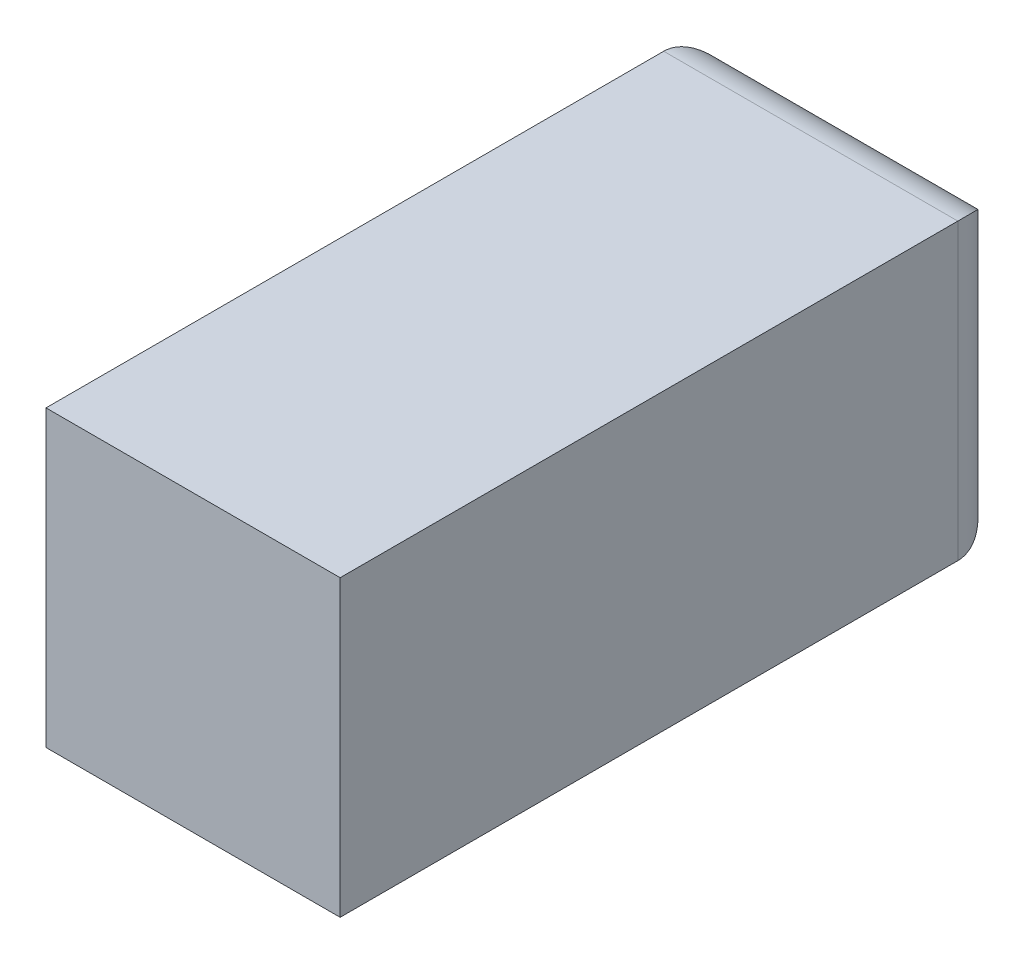
ISO-10303-21;
HEADER;
FILE_DESCRIPTION(('STEP AP214'),'2;1');
FILE_NAME('part.step','',(''),(''),'','','');
FILE_SCHEMA(('AUTOMOTIVE_DESIGN { 1 0 10303 214 1 1 1 1 }'));
ENDSEC;
DATA;
#1=APPLICATION_CONTEXT('core data for automotive mechanical design processes');
#2=APPLICATION_PROTOCOL_DEFINITION('international standard','automotive_design',2000,#1);
#3=PRODUCT_CONTEXT('',#1,'mechanical');
#4=PRODUCT('Part','Part','',(#3));
#5=PRODUCT_RELATED_PRODUCT_CATEGORY('part','',(#4));
#6=PRODUCT_DEFINITION_FORMATION('','',#4);
#7=PRODUCT_DEFINITION_CONTEXT('part definition',#1,'design');
#8=PRODUCT_DEFINITION('design','',#6,#7);
#9=PRODUCT_DEFINITION_SHAPE('','',#8);
#10=(LENGTH_UNIT() NAMED_UNIT(*) SI_UNIT(.MILLI.,.METRE.));
#11=(NAMED_UNIT(*) PLANE_ANGLE_UNIT() SI_UNIT($,.RADIAN.));
#12=(NAMED_UNIT(*) SI_UNIT($,.STERADIAN.) SOLID_ANGLE_UNIT());
#13=UNCERTAINTY_MEASURE_WITH_UNIT(LENGTH_MEASURE(1.E-05),#10,'distance_accuracy_value','');
#14=(GEOMETRIC_REPRESENTATION_CONTEXT(3) GLOBAL_UNCERTAINTY_ASSIGNED_CONTEXT((#13)) GLOBAL_UNIT_ASSIGNED_CONTEXT((#10,
#11,#12)) REPRESENTATION_CONTEXT('',''));
#15=CARTESIAN_POINT('',(0.,0.,0.));
#16=DIRECTION('',(0.,0.,1.));
#17=DIRECTION('',(1.,0.,0.));
#18=AXIS2_PLACEMENT_3D('',#15,#16,#17);
#19=CARTESIAN_POINT('',(0.,0.,34.));
#20=DIRECTION('',(1.,0.,0.));
#21=DIRECTION('',(0.,1.,0.));
#22=AXIS2_PLACEMENT_3D('',#19,#20,#21);
#23=PLANE('',#22);
#24=DIRECTION('',(0.,0.,-1.));
#25=VECTOR('',#24,1.);
#26=CARTESIAN_POINT('',(0.,15.,34.));
#27=LINE('',#26,#25);
#28=CARTESIAN_POINT('',(0.,15.,34.));
#29=VERTEX_POINT('',#28);
#30=CARTESIAN_POINT('',(0.,15.,2.5));
#31=VERTEX_POINT('',#30);
#32=EDGE_CURVE('E152',#29,#31,#27,.T.);
#33=ORIENTED_EDGE('',*,*,#32,.T.);
#34=DIRECTION('',(0.,-1.,0.));
#35=VECTOR('',#34,1.);
#36=CARTESIAN_POINT('',(0.,0.,2.5));
#37=LINE('',#36,#35);
#38=CARTESIAN_POINT('',(0.,0.,2.5));
#39=VERTEX_POINT('',#38);
#40=EDGE_CURVE('E11',#31,#39,#37,.T.);
#41=ORIENTED_EDGE('',*,*,#40,.T.);
#42=DIRECTION('',(0.,0.,-1.));
#43=VECTOR('',#42,1.);
#44=CARTESIAN_POINT('',(0.,0.,34.));
#45=LINE('',#44,#43);
#46=CARTESIAN_POINT('',(0.,0.,34.));
#47=VERTEX_POINT('',#46);
#48=EDGE_CURVE('E94',#47,#39,#45,.T.);
#49=ORIENTED_EDGE('',*,*,#48,.F.);
#50=DIRECTION('',(0.,-1.,0.));
#51=VECTOR('',#50,1.);
#52=CARTESIAN_POINT('',(0.,0.,34.));
#53=LINE('',#52,#51);
#54=EDGE_CURVE('E100',#29,#47,#53,.T.);
#55=ORIENTED_EDGE('',*,*,#54,.F.);
#56=EDGE_LOOP('',(#33,#41,#49,#55));
#57=FACE_BOUND('',#56,.T.);
#58=ADVANCED_FACE('F33',(#57),#23,.F.);
#59=CARTESIAN_POINT('',(0.,0.,34.));
#60=DIRECTION('',(0.,1.,0.));
#61=DIRECTION('',(0.,0.,1.));
#62=AXIS2_PLACEMENT_3D('',#59,#60,#61);
#63=PLANE('',#62);
#64=ORIENTED_EDGE('',*,*,#48,.T.);
#65=DIRECTION('',(1.,0.,0.));
#66=VECTOR('',#65,1.);
#67=CARTESIAN_POINT('',(15.,0.,2.5));
#68=LINE('',#67,#66);
#69=CARTESIAN_POINT('',(15.,0.,2.5));
#70=VERTEX_POINT('',#69);
#71=EDGE_CURVE('E109',#39,#70,#68,.T.);
#72=ORIENTED_EDGE('',*,*,#71,.T.);
#73=DIRECTION('',(0.,0.,-1.));
#74=VECTOR('',#73,1.);
#75=CARTESIAN_POINT('',(15.,0.,34.));
#76=LINE('',#75,#74);
#77=CARTESIAN_POINT('',(15.,0.,34.));
#78=VERTEX_POINT('',#77);
#79=EDGE_CURVE('E96',#78,#70,#76,.T.);
#80=ORIENTED_EDGE('',*,*,#79,.F.);
#81=DIRECTION('',(1.,0.,0.));
#82=VECTOR('',#81,1.);
#83=CARTESIAN_POINT('',(0.,0.,34.));
#84=LINE('',#83,#82);
#85=EDGE_CURVE('E89',#47,#78,#84,.T.);
#86=ORIENTED_EDGE('',*,*,#85,.F.);
#87=EDGE_LOOP('',(#64,#72,#80,#86));
#88=FACE_BOUND('',#87,.T.);
#89=ADVANCED_FACE('F91',(#88),#63,.F.);
#90=CARTESIAN_POINT('',(15.,0.,34.));
#91=DIRECTION('',(-1.,0.,0.));
#92=DIRECTION('',(0.,-1.,0.));
#93=AXIS2_PLACEMENT_3D('',#90,#91,#92);
#94=PLANE('',#93);
#95=ORIENTED_EDGE('',*,*,#79,.T.);
#96=DIRECTION('',(0.,1.,0.));
#97=VECTOR('',#96,1.);
#98=CARTESIAN_POINT('',(15.,15.,2.5));
#99=LINE('',#98,#97);
#100=CARTESIAN_POINT('',(15.,15.,2.5));
#101=VERTEX_POINT('',#100);
#102=EDGE_CURVE('E57',#70,#101,#99,.T.);
#103=ORIENTED_EDGE('',*,*,#102,.T.);
#104=DIRECTION('',(0.,0.,-1.));
#105=VECTOR('',#104,1.);
#106=CARTESIAN_POINT('',(15.,15.,34.));
#107=LINE('',#106,#105);
#108=CARTESIAN_POINT('',(15.,15.,34.));
#109=VERTEX_POINT('',#108);
#110=EDGE_CURVE('E113',#109,#101,#107,.T.);
#111=ORIENTED_EDGE('',*,*,#110,.F.);
#112=DIRECTION('',(0.,1.,0.));
#113=VECTOR('',#112,1.);
#114=CARTESIAN_POINT('',(15.,0.,34.));
#115=LINE('',#114,#113);
#116=EDGE_CURVE('E99',#78,#109,#115,.T.);
#117=ORIENTED_EDGE('',*,*,#116,.F.);
#118=EDGE_LOOP('',(#95,#103,#111,#117));
#119=FACE_BOUND('',#118,.T.);
#120=ADVANCED_FACE('F150',(#119),#94,.F.);
#121=CARTESIAN_POINT('',(0.,15.,34.));
#122=DIRECTION('',(0.,-1.,0.));
#123=DIRECTION('',(0.,0.,-1.));
#124=AXIS2_PLACEMENT_3D('',#121,#122,#123);
#125=PLANE('',#124);
#126=ORIENTED_EDGE('',*,*,#110,.T.);
#127=DIRECTION('',(-1.,0.,0.));
#128=VECTOR('',#127,1.);
#129=CARTESIAN_POINT('',(0.,15.,2.5));
#130=LINE('',#129,#128);
#131=EDGE_CURVE('E42',#101,#31,#130,.T.);
#132=ORIENTED_EDGE('',*,*,#131,.T.);
#133=ORIENTED_EDGE('',*,*,#32,.F.);
#134=DIRECTION('',(-1.,0.,0.));
#135=VECTOR('',#134,1.);
#136=CARTESIAN_POINT('',(0.,15.,34.));
#137=LINE('',#136,#135);
#138=EDGE_CURVE('E105',#109,#29,#137,.T.);
#139=ORIENTED_EDGE('',*,*,#138,.F.);
#140=EDGE_LOOP('',(#126,#132,#133,#139));
#141=FACE_BOUND('',#140,.T.);
#142=ADVANCED_FACE('F155',(#141),#125,.F.);
#143=CARTESIAN_POINT('',(0.,0.,34.));
#144=DIRECTION('',(0.,0.,-1.));
#145=DIRECTION('',(-1.,0.,0.));
#146=AXIS2_PLACEMENT_3D('',#143,#144,#145);
#147=PLANE('',#146);
#148=ORIENTED_EDGE('',*,*,#54,.T.);
#149=ORIENTED_EDGE('',*,*,#85,.T.);
#150=ORIENTED_EDGE('',*,*,#116,.T.);
#151=ORIENTED_EDGE('',*,*,#138,.T.);
#152=EDGE_LOOP('',(#148,#149,#150,#151));
#153=FACE_BOUND('',#152,.T.);
#154=ADVANCED_FACE('F103',(#153),#147,.F.);
#155=CARTESIAN_POINT('',(0.,0.,0.));
#156=DIRECTION('',(0.,0.,-1.));
#157=DIRECTION('',(-1.,0.,0.));
#158=AXIS2_PLACEMENT_3D('',#155,#156,#157);
#159=PLANE('',#158);
#160=DIRECTION('',(0.,1.,0.));
#161=VECTOR('',#160,1.);
#162=CARTESIAN_POINT('',(12.5,0.,0.));
#163=LINE('',#162,#161);
#164=CARTESIAN_POINT('',(12.5,12.5,0.));
#165=VERTEX_POINT('',#164);
#166=CARTESIAN_POINT('',(12.5,2.5,0.));
#167=VERTEX_POINT('',#166);
#168=EDGE_CURVE('E120',#165,#167,#163,.F.);
#169=ORIENTED_EDGE('',*,*,#168,.T.);
#170=DIRECTION('',(1.,0.,0.));
#171=VECTOR('',#170,1.);
#172=CARTESIAN_POINT('',(0.,2.5,0.));
#173=LINE('',#172,#171);
#174=CARTESIAN_POINT('',(2.5,2.5,0.));
#175=VERTEX_POINT('',#174);
#176=EDGE_CURVE('E122',#167,#175,#173,.F.);
#177=ORIENTED_EDGE('',*,*,#176,.T.);
#178=DIRECTION('',(0.,-1.,0.));
#179=VECTOR('',#178,1.);
#180=CARTESIAN_POINT('',(2.5,15.,0.));
#181=LINE('',#180,#179);
#182=CARTESIAN_POINT('',(2.5,12.5,0.));
#183=VERTEX_POINT('',#182);
#184=EDGE_CURVE('E111',#175,#183,#181,.F.);
#185=ORIENTED_EDGE('',*,*,#184,.T.);
#186=DIRECTION('',(-1.,0.,0.));
#187=VECTOR('',#186,1.);
#188=CARTESIAN_POINT('',(15.,12.5,0.));
#189=LINE('',#188,#187);
#190=EDGE_CURVE('E118',#183,#165,#189,.F.);
#191=ORIENTED_EDGE('',*,*,#190,.T.);
#192=EDGE_LOOP('',(#169,#177,#185,#191));
#193=FACE_BOUND('',#192,.T.);
#194=ADVANCED_FACE('F143',(#193),#159,.T.);
#195=CARTESIAN_POINT('',(0.,12.5,2.5));
#196=DIRECTION('',(1.,0.,0.));
#197=DIRECTION('',(0.,0.,-1.));
#198=AXIS2_PLACEMENT_3D('',#195,#196,#197);
#199=CYLINDRICAL_SURFACE('',#198,2.5);
#200=CARTESIAN_POINT('',(12.5,12.5,2.5));
#201=DIRECTION('',(0.707106781186548,-0.707106781186547,0.));
#202=DIRECTION('',(0.707106781186547,0.707106781186548,0.));
#203=AXIS2_PLACEMENT_3D('',#200,#201,#202);
#204=ELLIPSE('',#203,3.53553390593274,2.5);
#205=EDGE_CURVE('E130',#165,#101,#204,.T.);
#206=ORIENTED_EDGE('',*,*,#205,.F.);
#207=ORIENTED_EDGE('',*,*,#190,.F.);
#208=CARTESIAN_POINT('',(2.5,12.5,2.5));
#209=DIRECTION('',(0.707106781186547,0.707106781186548,0.));
#210=DIRECTION('',(-0.707106781186548,0.707106781186547,0.));
#211=AXIS2_PLACEMENT_3D('',#208,#209,#210);
#212=ELLIPSE('',#211,3.53553390593274,2.5);
#213=EDGE_CURVE('E37',#31,#183,#212,.F.);
#214=ORIENTED_EDGE('',*,*,#213,.F.);
#215=ORIENTED_EDGE('',*,*,#131,.F.);
#216=EDGE_LOOP('',(#206,#207,#214,#215));
#217=FACE_BOUND('',#216,.T.);
#218=ADVANCED_FACE('F35',(#217),#199,.T.);
#219=CARTESIAN_POINT('',(2.5,0.,2.5));
#220=DIRECTION('',(0.,1.,0.));
#221=DIRECTION('',(-1.,0.,0.));
#222=AXIS2_PLACEMENT_3D('',#219,#220,#221);
#223=CYLINDRICAL_SURFACE('',#222,2.5);
#224=ORIENTED_EDGE('',*,*,#213,.T.);
#225=ORIENTED_EDGE('',*,*,#184,.F.);
#226=CARTESIAN_POINT('',(2.5,2.5,2.5));
#227=DIRECTION('',(-0.707106781186548,0.707106781186547,0.));
#228=DIRECTION('',(0.707106781186547,0.707106781186548,0.));
#229=AXIS2_PLACEMENT_3D('',#226,#227,#228);
#230=ELLIPSE('',#229,3.53553390593274,2.5);
#231=EDGE_CURVE('E129',#39,#175,#230,.F.);
#232=ORIENTED_EDGE('',*,*,#231,.F.);
#233=ORIENTED_EDGE('',*,*,#40,.F.);
#234=EDGE_LOOP('',(#224,#225,#232,#233));
#235=FACE_BOUND('',#234,.T.);
#236=ADVANCED_FACE('F139',(#235),#223,.T.);
#237=CARTESIAN_POINT('',(12.5,0.,2.5));
#238=DIRECTION('',(0.,-1.,0.));
#239=DIRECTION('',(1.,0.,0.));
#240=AXIS2_PLACEMENT_3D('',#237,#238,#239);
#241=CYLINDRICAL_SURFACE('',#240,2.5);
#242=ORIENTED_EDGE('',*,*,#205,.T.);
#243=ORIENTED_EDGE('',*,*,#102,.F.);
#244=CARTESIAN_POINT('',(12.5,2.5,2.5));
#245=DIRECTION('',(-0.707106781186547,-0.707106781186548,0.));
#246=DIRECTION('',(0.707106781186548,-0.707106781186547,0.));
#247=AXIS2_PLACEMENT_3D('',#244,#245,#246);
#248=ELLIPSE('',#247,3.53553390593274,2.5);
#249=EDGE_CURVE('E127',#167,#70,#248,.T.);
#250=ORIENTED_EDGE('',*,*,#249,.F.);
#251=ORIENTED_EDGE('',*,*,#168,.F.);
#252=EDGE_LOOP('',(#242,#243,#250,#251));
#253=FACE_BOUND('',#252,.T.);
#254=ADVANCED_FACE('F149',(#253),#241,.T.);
#255=CARTESIAN_POINT('',(0.,2.5,2.5));
#256=DIRECTION('',(-1.,0.,0.));
#257=DIRECTION('',(0.,0.,1.));
#258=AXIS2_PLACEMENT_3D('',#255,#256,#257);
#259=CYLINDRICAL_SURFACE('',#258,2.5);
#260=ORIENTED_EDGE('',*,*,#231,.T.);
#261=ORIENTED_EDGE('',*,*,#176,.F.);
#262=ORIENTED_EDGE('',*,*,#249,.T.);
#263=ORIENTED_EDGE('',*,*,#71,.F.);
#264=EDGE_LOOP('',(#260,#261,#262,#263));
#265=FACE_BOUND('',#264,.T.);
#266=ADVANCED_FACE('F147',(#265),#259,.T.);
#267=CLOSED_SHELL('',(#58,#89,#120,#142,#154,#194,#218,#236,#254,#266));
#268=MANIFOLD_SOLID_BREP('B2',#267);
#269=ADVANCED_BREP_SHAPE_REPRESENTATION('',(#18,#268),#14);
#270=SHAPE_DEFINITION_REPRESENTATION(#9,#269);
ENDSEC;
END-ISO-10303-21;
